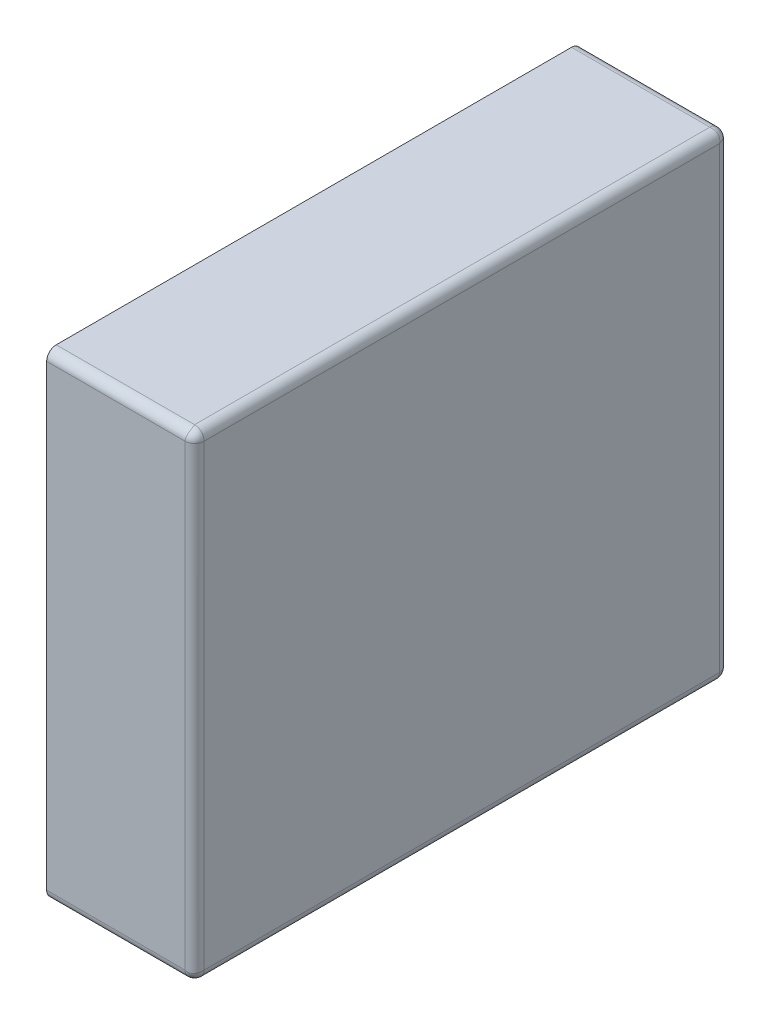
ISO-10303-21;
HEADER;
FILE_DESCRIPTION(('STEP AP214'),'2;1');
FILE_NAME('part.step','',(''),(''),'','','');
FILE_SCHEMA(('AUTOMOTIVE_DESIGN { 1 0 10303 214 1 1 1 1 }'));
ENDSEC;
DATA;
#1=APPLICATION_CONTEXT('core data for automotive mechanical design processes');
#2=APPLICATION_PROTOCOL_DEFINITION('international standard','automotive_design',2000,#1);
#3=PRODUCT_CONTEXT('',#1,'mechanical');
#4=PRODUCT('Part','Part','',(#3));
#5=PRODUCT_RELATED_PRODUCT_CATEGORY('part','',(#4));
#6=PRODUCT_DEFINITION_FORMATION('','',#4);
#7=PRODUCT_DEFINITION_CONTEXT('part definition',#1,'design');
#8=PRODUCT_DEFINITION('design','',#6,#7);
#9=PRODUCT_DEFINITION_SHAPE('','',#8);
#10=(LENGTH_UNIT() NAMED_UNIT(*) SI_UNIT(.MILLI.,.METRE.));
#11=(NAMED_UNIT(*) PLANE_ANGLE_UNIT() SI_UNIT($,.RADIAN.));
#12=(NAMED_UNIT(*) SI_UNIT($,.STERADIAN.) SOLID_ANGLE_UNIT());
#13=UNCERTAINTY_MEASURE_WITH_UNIT(LENGTH_MEASURE(1.E-05),#10,'distance_accuracy_value','');
#14=(GEOMETRIC_REPRESENTATION_CONTEXT(3) GLOBAL_UNCERTAINTY_ASSIGNED_CONTEXT((#13)) GLOBAL_UNIT_ASSIGNED_CONTEXT((#10,
#11,#12)) REPRESENTATION_CONTEXT('',''));
#15=CARTESIAN_POINT('',(0.,0.,0.));
#16=DIRECTION('',(0.,0.,1.));
#17=DIRECTION('',(1.,0.,0.));
#18=AXIS2_PLACEMENT_3D('',#15,#16,#17);
#19=CARTESIAN_POINT('',(0.25,-1.5583333105542,0.05));
#20=DIRECTION('',(-0.816496580927726,-0.408248290463864,-0.408248290463862));
#21=DIRECTION('',(0.577350269189626,-0.577350269189626,-0.577350269189625));
#22=AXIS2_PLACEMENT_3D('',#19,#20,#21);
#23=SPHERICAL_SURFACE('',#22,0.05);
#24=CARTESIAN_POINT('',(0.25,-1.5583333105542,0.05));
#25=DIRECTION('',(1.,0.,0.));
#26=DIRECTION('',(0.,0.,-1.));
#27=AXIS2_PLACEMENT_3D('',#24,#25,#26);
#28=CIRCLE('',#27,0.05);
#29=CARTESIAN_POINT('',(0.25,-1.6083333105542,0.05));
#30=VERTEX_POINT('',#29);
#31=CARTESIAN_POINT('',(0.25,-1.5583333105542,0.));
#32=VERTEX_POINT('',#31);
#33=EDGE_CURVE('E11',#30,#32,#28,.T.);
#34=ORIENTED_EDGE('',*,*,#33,.T.);
#35=CARTESIAN_POINT('',(0.25,-1.5583333105542,0.05));
#36=DIRECTION('',(0.,-1.,0.));
#37=DIRECTION('',(1.,0.,0.));
#38=AXIS2_PLACEMENT_3D('',#35,#36,#37);
#39=CIRCLE('',#38,0.05);
#40=CARTESIAN_POINT('',(0.3,-1.5583333105542,0.05));
#41=VERTEX_POINT('',#40);
#42=EDGE_CURVE('E24',#32,#41,#39,.T.);
#43=ORIENTED_EDGE('',*,*,#42,.T.);
#44=CARTESIAN_POINT('',(0.25,-1.5583333105542,0.05));
#45=DIRECTION('',(0.,0.,-1.));
#46=DIRECTION('',(0.,-1.,0.));
#47=AXIS2_PLACEMENT_3D('',#44,#45,#46);
#48=CIRCLE('',#47,0.05);
#49=EDGE_CURVE('E289',#41,#30,#48,.T.);
#50=ORIENTED_EDGE('',*,*,#49,.T.);
#51=EDGE_LOOP('',(#34,#43,#50));
#52=FACE_BOUND('',#51,.T.);
#53=ADVANCED_FACE('F17',(#52),#23,.T.);
#54=CARTESIAN_POINT('',(0.25,-1.5583333105542,2.75));
#55=DIRECTION('',(0.408248290463863,-0.408248290463863,-0.816496580927726));
#56=DIRECTION('',(0.577350269189625,-0.577350269189626,0.577350269189626));
#57=AXIS2_PLACEMENT_3D('',#54,#55,#56);
#58=SPHERICAL_SURFACE('',#57,0.05);
#59=CARTESIAN_POINT('',(0.25,-1.5583333105542,2.75));
#60=DIRECTION('',(1.,0.,0.));
#61=DIRECTION('',(0.,-1.,0.));
#62=AXIS2_PLACEMENT_3D('',#59,#60,#61);
#63=CIRCLE('',#62,0.05);
#64=CARTESIAN_POINT('',(0.25,-1.5583333105542,2.8));
#65=VERTEX_POINT('',#64);
#66=CARTESIAN_POINT('',(0.25,-1.6083333105542,2.75));
#67=VERTEX_POINT('',#66);
#68=EDGE_CURVE('E285',#65,#67,#63,.T.);
#69=ORIENTED_EDGE('',*,*,#68,.T.);
#70=CARTESIAN_POINT('',(0.25,-1.5583333105542,2.75));
#71=DIRECTION('',(0.,0.,1.));
#72=DIRECTION('',(1.,0.,0.));
#73=AXIS2_PLACEMENT_3D('',#70,#71,#72);
#74=CIRCLE('',#73,0.05);
#75=CARTESIAN_POINT('',(0.3,-1.5583333105542,2.75));
#76=VERTEX_POINT('',#75);
#77=EDGE_CURVE('E287',#67,#76,#74,.T.);
#78=ORIENTED_EDGE('',*,*,#77,.T.);
#79=CARTESIAN_POINT('',(0.3,-1.5583333105542,2.75));
#80=CARTESIAN_POINT('',(0.300000020313967,-1.55838978719508,2.75083135242767));
#81=CARTESIAN_POINT('',(0.299979171317549,-1.55845447886576,2.75166211112483));
#82=CARTESIAN_POINT('',(0.299895695565037,-1.55859870174982,2.75332402424875));
#83=CARTESIAN_POINT('',(0.299832880868058,-1.55867829855564,2.75415516357154));
#84=CARTESIAN_POINT('',(0.299665097579262,-1.55885054522584,2.75581523610608));
#85=CARTESIAN_POINT('',(0.299559959502558,-1.55894324658754,2.75664414679495));
#86=CARTESIAN_POINT('',(0.299307372398355,-1.55913983137091,2.75829721664536));
#87=CARTESIAN_POINT('',(0.299159773963409,-1.55924375345445,2.75912134835722));
#88=CARTESIAN_POINT('',(0.298822292392348,-1.55946083930706,2.76076234724915));
#89=CARTESIAN_POINT('',(0.298632281058567,-1.55957403042181,2.76157918442682));
#90=CARTESIAN_POINT('',(0.298210195281024,-1.55980765473083,2.76320313201674));
#91=CARTESIAN_POINT('',(0.297978014684369,-1.55992810567705,2.76401021227114));
#92=CARTESIAN_POINT('',(0.297472005262752,-1.56017420274978,2.76561224116745));
#93=CARTESIAN_POINT('',(0.297198092814036,-1.56029985893012,2.76640716184318));
#94=CARTESIAN_POINT('',(0.296609228401466,-1.56055428410327,2.76798253353389));
#95=CARTESIAN_POINT('',(0.29629421548598,-1.56068305748316,2.76876296105217));
#96=CARTESIAN_POINT('',(0.29562395131688,-1.56094161136505,2.7703070834178));
#97=CARTESIAN_POINT('',(0.295268661584212,-1.56107139271792,2.77107076141787));
#98=CARTESIAN_POINT('',(0.294518835357465,-1.5613298458026,2.77257920486178));
#99=CARTESIAN_POINT('',(0.294124282319878,-1.56145851704164,2.7733239621661));
#100=CARTESIAN_POINT('',(0.293297108379355,-1.56171263446717,2.77479247507204));
#101=CARTESIAN_POINT('',(0.292864492001337,-1.56183808103473,2.77551623315645));
#102=CARTESIAN_POINT('',(0.291962553597264,-1.56208364738235,2.77694075639946));
#103=CARTESIAN_POINT('',(0.291493255977843,-1.5622037706224,2.77764153641367));
#104=CARTESIAN_POINT('',(0.290519495705679,-1.56243661461909,2.7790182169205));
#105=CARTESIAN_POINT('',(0.290015075848481,-1.56254934407038,2.77969414620939));
#106=CARTESIAN_POINT('',(0.288972784289588,-1.56276536306717,2.78101934949802));
#107=CARTESIAN_POINT('',(0.288434971990044,-1.56286866861168,2.78166866760279));
#108=CARTESIAN_POINT('',(0.287327774609329,-1.56306385270868,2.78293898925504));
#109=CARTESIAN_POINT('',(0.286758463484927,-1.56315575651191,2.78356005336898));
#110=CARTESIAN_POINT('',(0.285590305843476,-1.56332621220327,2.7847723293902));
#111=CARTESIAN_POINT('',(0.28499154553938,-1.56340480038347,2.7853636192483));
#112=CARTESIAN_POINT('',(0.283766676890247,-1.56354677359816,2.78651493527515));
#113=CARTESIAN_POINT('',(0.283140664496341,-1.56361020756323,2.78707505745919));
#114=CARTESIAN_POINT('',(0.281863619839021,-1.56372010598015,2.78816275678178));
#115=CARTESIAN_POINT('',(0.281212690558093,-1.56376663337246,2.78869044842568));
#116=CARTESIAN_POINT('',(0.279888271236327,-1.56384104789288,2.78971213879615));
#117=CARTESIAN_POINT('',(0.279214888348585,-1.56386901308495,2.79020627067896));
#118=CARTESIAN_POINT('',(0.277848141278855,-1.56390473834771,2.79115982988534));
#119=CARTESIAN_POINT('',(0.277154885445235,-1.56391259243202,2.79161940890336));
#120=CARTESIAN_POINT('',(0.275751081087255,-1.56390664626746,2.79250298909048));
#121=CARTESIAN_POINT('',(0.275040639060477,-1.5638929564933,2.79292716009926));
#122=CARTESIAN_POINT('',(0.273605248184243,-1.56384259819796,2.79373919083561));
#123=CARTESIAN_POINT('',(0.272880400913832,-1.5638060567854,2.79412723787));
#124=CARTESIAN_POINT('',(0.271419070457526,-1.56370880417603,2.79486642792602));
#125=CARTESIAN_POINT('',(0.270682680895238,-1.56364823653573,2.79521777475648));
#126=CARTESIAN_POINT('',(0.269201208347948,-1.56350188148719,2.7958831127108));
#127=CARTESIAN_POINT('',(0.268456208087868,-1.56341625352492,2.79619732289344));
#128=CARTESIAN_POINT('',(0.266960517038454,-1.56321887666677,2.79678807615493));
#129=CARTESIAN_POINT('',(0.266209895271862,-1.56310730216158,2.79706485201088));
#130=CARTESIAN_POINT('',(0.264706002926951,-1.56285728385359,2.79758056582694));
#131=CARTESIAN_POINT('',(0.263952785138195,-1.5627190280733,2.79781974846915));
#132=CARTESIAN_POINT('',(0.262446796385434,-1.56241506595262,2.79826023919175));
#133=CARTESIAN_POINT('',(0.261694059537444,-1.56224955951653,2.79846180182021));
#134=CARTESIAN_POINT('',(0.260192060427522,-1.56189065428056,2.79882716569432));
#135=CARTESIAN_POINT('',(0.259442812292273,-1.56169746538555,2.7989912289485));
#136=CARTESIAN_POINT('',(0.258321945507501,-1.56138604292381,2.79920955873537));
#137=CARTESIAN_POINT('',(0.257949832604319,-1.56127894943598,2.79927756015494));
#138=CARTESIAN_POINT('',(0.257207637428366,-1.5610577417209,2.7994042588909));
#139=CARTESIAN_POINT('',(0.256837552741953,-1.56094365499532,2.79946298976778));
#140=CARTESIAN_POINT('',(0.256099812695661,-1.56070846003553,2.79957119336077));
#141=CARTESIAN_POINT('',(0.255732153421865,-1.56058737954348,2.79962069975311));
#142=CARTESIAN_POINT('',(0.254999641822439,-1.56033820255821,2.7997105129861));
#143=CARTESIAN_POINT('',(0.254634784141684,-1.56021013397265,2.79975085351181));
#144=CARTESIAN_POINT('',(0.253908256305697,-1.55994699823989,2.79982239989622));
#145=CARTESIAN_POINT('',(0.253546579332125,-1.55981195906698,2.79985363936352));
#146=CARTESIAN_POINT('',(0.25282678964261,-1.55953491034398,2.79990705649925));
#147=CARTESIAN_POINT('',(0.252468668656838,-1.55939292873802,2.79992926760641));
#148=CARTESIAN_POINT('',(0.251756364451594,-1.55910203332603,2.79996470752091));
#149=CARTESIAN_POINT('',(0.251402171529021,-1.55895314733816,2.79997796950743));
#150=CARTESIAN_POINT('',(0.250698095332166,-1.55864849552808,2.79999560007552));
#151=CARTESIAN_POINT('',(0.250348200942932,-1.55849275728552,2.8000000014759));
#152=CARTESIAN_POINT('',(0.25,-1.5583333105542,2.8));
#153=B_SPLINE_CURVE_WITH_KNOTS('',3,(#79,#80,#81,#82,#83,#84,#85,#86,#87,#88,#89,#90,#91,#92,
#93,#94,#95,#96,#97,#98,#99,#100,#101,#102,#103,#104,#105,#106,#107,#108,#109,#110,#111,#112,
#113,#114,#115,#116,#117,#118,#119,#120,#121,#122,#123,#124,#125,#126,#127,#128,#129,#130,#131,
#132,#133,#134,#135,#136,#137,#138,#139,#140,#141,#142,#143,#144,#145,#146,#147,#148,#149,#150,
#151,#152),.UNSPECIFIED.,.F.,.F.,(4,2,2,2,2,2,2,2,2,2,2,2,2,2,2,2,2,2,2,2,2,2,2,2,2,2,2,2,2,2,2,
2,2,2,2,2,4),(0.,0.00249945349828842,0.00501017636236163,0.00753105510997415,0.010060915036224,
0.0125985278601289,0.0151426194708621,0.017691877752768,0.0202449604712911,0.0228005032044076,
0.0253571273060388,0.0279134478892864,0.0304680818182009,0.0330196556971652,0.0355668138468767,
0.0381082262553104,0.0406425964909794,0.0431686695642028,0.0456852397199662,0.048191158143267,
0.0506853405545278,0.0531667746687542,0.0556345274875086,0.0580877523875283,0.0605256959638785,
0.0629477045789643,0.0653532305615733,0.0677418379925142,0.0701132080055176,0.0712924926926685,
0.0724674051483095,0.0736379404537152,0.0748041017706804,0.0759659004268234,0.077123355986903,
0.0782764963093341,0.0794253575870824),.UNSPECIFIED.);
#154=EDGE_CURVE('E253',#76,#65,#153,.T.);
#155=ORIENTED_EDGE('',*,*,#154,.T.);
#156=EDGE_LOOP('',(#69,#78,#155));
#157=FACE_BOUND('',#156,.T.);
#158=ADVANCED_FACE('F270',(#157),#58,.T.);
#159=CARTESIAN_POINT('',(0.25,-1.5583333105542,0.));
#160=DIRECTION('',(0.,0.,1.));
#161=DIRECTION('',(0.707106781186548,-0.707106781186548,0.));
#162=AXIS2_PLACEMENT_3D('',#159,#160,#161);
#163=CYLINDRICAL_SURFACE('',#162,0.05);
#164=ORIENTED_EDGE('',*,*,#77,.F.);
#165=DIRECTION('',(0.,0.,-1.));
#166=VECTOR('',#165,1.);
#167=CARTESIAN_POINT('',(0.25,-1.6083333105542,0.));
#168=LINE('',#167,#166);
#169=EDGE_CURVE('E250',#67,#30,#168,.T.);
#170=ORIENTED_EDGE('',*,*,#169,.T.);
#171=ORIENTED_EDGE('',*,*,#49,.F.);
#172=DIRECTION('',(0.,0.,1.));
#173=VECTOR('',#172,1.);
#174=CARTESIAN_POINT('',(0.3,-1.5583333105542,0.));
#175=LINE('',#174,#173);
#176=EDGE_CURVE('E247',#41,#76,#175,.T.);
#177=ORIENTED_EDGE('',*,*,#176,.T.);
#178=EDGE_LOOP('',(#164,#170,#171,#177));
#179=FACE_BOUND('',#178,.T.);
#180=ADVANCED_FACE('F228',(#179),#163,.T.);
#181=CARTESIAN_POINT('',(0.25,0.841666689445808,0.05));
#182=DIRECTION('',(-0.816496580927726,0.408248290463864,-0.408248290463862));
#183=DIRECTION('',(0.577350269189626,0.577350269189626,-0.577350269189626));
#184=AXIS2_PLACEMENT_3D('',#181,#182,#183);
#185=SPHERICAL_SURFACE('',#184,0.05);
#186=CARTESIAN_POINT('',(0.3,0.841666689445808,0.05));
#187=CARTESIAN_POINT('',(0.300000001475902,0.841826136177128,0.0496517990570679));
#188=CARTESIAN_POINT('',(0.299995600075518,0.841981874419691,0.0493019046678338));
#189=CARTESIAN_POINT('',(0.299977969507428,0.842286526229773,0.0485978284709789));
#190=CARTESIAN_POINT('',(0.29996470752091,0.842435412217634,0.0482436355484063));
#191=CARTESIAN_POINT('',(0.29992926760641,0.842726307629632,0.0475313313431616));
#192=CARTESIAN_POINT('',(0.299907056499251,0.842868289235589,0.04717321035739));
#193=CARTESIAN_POINT('',(0.299853639363523,0.843145337958589,0.0464534206678749));
#194=CARTESIAN_POINT('',(0.299822399896224,0.843280377131498,0.0460917436943032));
#195=CARTESIAN_POINT('',(0.299750853511815,0.843543512864263,0.0453652158583164));
#196=CARTESIAN_POINT('',(0.299710512986096,0.843671581449818,0.0450003581775609));
#197=CARTESIAN_POINT('',(0.299620699753114,0.843920758435086,0.0442678465781354));
#198=CARTESIAN_POINT('',(0.299571193360768,0.844041838927135,0.0439001873043393));
#199=CARTESIAN_POINT('',(0.299462989767779,0.844277033886932,0.0431624472580472));
#200=CARTESIAN_POINT('',(0.2994042588909,0.844391120612505,0.0427923625716341));
#201=CARTESIAN_POINT('',(0.299277560154943,0.844612328327585,0.0420501673956814));
#202=CARTESIAN_POINT('',(0.29920955873537,0.844719421815417,0.0416780544924992));
#203=CARTESIAN_POINT('',(0.298991228948502,0.845030844277154,0.0405571877077268));
#204=CARTESIAN_POINT('',(0.298827165694317,0.845224033172167,0.0398079395724777));
#205=CARTESIAN_POINT('',(0.298461801820209,0.845582938408141,0.0383059404625555));
#206=CARTESIAN_POINT('',(0.298260239191747,0.845748444844225,0.0375532036145659));
#207=CARTESIAN_POINT('',(0.29781974846915,0.846052406964906,0.0360472148618045));
#208=CARTESIAN_POINT('',(0.297580565826942,0.846190662745201,0.035293997073049));
#209=CARTESIAN_POINT('',(0.297064852010877,0.846440681053184,0.0337901047281377));
#210=CARTESIAN_POINT('',(0.296788076154931,0.846552255558383,0.0330394829615458));
#211=CARTESIAN_POINT('',(0.296197322893436,0.846749632416525,0.0315437919121317));
#212=CARTESIAN_POINT('',(0.295883112710797,0.8468352603788,0.0307987916520525));
#213=CARTESIAN_POINT('',(0.295217774756478,0.846981615427333,0.0293173191047621));
#214=CARTESIAN_POINT('',(0.294866427926017,0.847042183067639,0.0285809295424739));
#215=CARTESIAN_POINT('',(0.294127237870004,0.847139435677007,0.0271195990861678));
#216=CARTESIAN_POINT('',(0.293739190835606,0.847175977089571,0.0263947518157568));
#217=CARTESIAN_POINT('',(0.292927160099263,0.847226335384911,0.024959360939523));
#218=CARTESIAN_POINT('',(0.292502989090476,0.847240025159069,0.0242489189127446));
#219=CARTESIAN_POINT('',(0.291619408903357,0.847245971323631,0.022845114554765));
#220=CARTESIAN_POINT('',(0.291159829885339,0.847238117239316,0.0221518587211452));
#221=CARTESIAN_POINT('',(0.290206270678963,0.847202391976558,0.0207851116514152));
#222=CARTESIAN_POINT('',(0.289712138796154,0.847174426784487,0.0201117287636731));
#223=CARTESIAN_POINT('',(0.288690448425676,0.847100012264066,0.018787309441907));
#224=CARTESIAN_POINT('',(0.288162756781776,0.847053484871761,0.0181363801609791));
#225=CARTESIAN_POINT('',(0.287075057459189,0.846943586454834,0.0168593355036592));
#226=CARTESIAN_POINT('',(0.286514935275151,0.846880152489767,0.0162333231097527));
#227=CARTESIAN_POINT('',(0.2853636192483,0.846738179275083,0.0150084544606196));
#228=CARTESIAN_POINT('',(0.284772329390201,0.846659591094879,0.0144096941565242));
#229=CARTESIAN_POINT('',(0.283560053368979,0.846489135403516,0.0132415365150735));
#230=CARTESIAN_POINT('',(0.282938989255036,0.846397231600287,0.0126722253906709));
#231=CARTESIAN_POINT('',(0.281668667602786,0.846202047503286,0.0115650280099562));
#232=CARTESIAN_POINT('',(0.281019349498018,0.846098741958783,0.0110272157104117));
#233=CARTESIAN_POINT('',(0.279694146209385,0.845882722961985,0.00998492415151916));
#234=CARTESIAN_POINT('',(0.279018216920503,0.845769993510699,0.00948050429432074));
#235=CARTESIAN_POINT('',(0.277641536413672,0.845537149514013,0.00850674402215684));
#236=CARTESIAN_POINT('',(0.276940756399464,0.845417026273957,0.0080374464027357));
#237=CARTESIAN_POINT('',(0.27551623315645,0.845171459926336,0.00713550799866327));
#238=CARTESIAN_POINT('',(0.274792475072041,0.84504601335878,0.00670289162064473));
#239=CARTESIAN_POINT('',(0.273323962166104,0.844791895933245,0.00587571768012181));
#240=CARTESIAN_POINT('',(0.272579204861783,0.844663224694207,0.00548116464253525));
#241=CARTESIAN_POINT('',(0.271070761417873,0.84440477160953,0.00473133841578785));
#242=CARTESIAN_POINT('',(0.270307083417801,0.844274990256661,0.00437604868311979));
#243=CARTESIAN_POINT('',(0.26876296105217,0.844016436374764,0.00370578451402038));
#244=CARTESIAN_POINT('',(0.267982533533888,0.843887662994882,0.00339077159853354));
#245=CARTESIAN_POINT('',(0.266407161843179,0.843633237821733,0.00280190718596448));
#246=CARTESIAN_POINT('',(0.265612241167447,0.843507581641384,0.00252799473724834));
#247=CARTESIAN_POINT('',(0.264010212271137,0.843261484568661,0.00202198531563093));
#248=CARTESIAN_POINT('',(0.263203132016743,0.843141033622434,0.00178980471897604));
#249=CARTESIAN_POINT('',(0.261579184426824,0.842907409313417,0.00136771894143311));
#250=CARTESIAN_POINT('',(0.260762347249152,0.84279421819867,0.00117770760765169));
#251=CARTESIAN_POINT('',(0.259121348357221,0.842577132346058,0.000840226036591079));
#252=CARTESIAN_POINT('',(0.258297216645363,0.842473210262514,0.000692627601644534));
#253=CARTESIAN_POINT('',(0.256644146794953,0.842276625479144,0.000440040497442491));
#254=CARTESIAN_POINT('',(0.255815236106077,0.842183924117451,0.000334902420738303));
#255=CARTESIAN_POINT('',(0.254155163571538,0.842011677447247,0.000167119131942066));
#256=CARTESIAN_POINT('',(0.253324024248752,0.841932080641431,0.000104304434962569));
#257=CARTESIAN_POINT('',(0.251662111124828,0.841787857757365,2.08286824513746E-05));
#258=CARTESIAN_POINT('',(0.250831352427667,0.84172316608669,-2.03139669171693E-08));
#259=CARTESIAN_POINT('',(0.25,0.841666689445808,0.));
#260=B_SPLINE_CURVE_WITH_KNOTS('',3,(#186,#187,#188,#189,#190,#191,#192,#193,#194,#195,#196,
#197,#198,#199,#200,#201,#202,#203,#204,#205,#206,#207,#208,#209,#210,#211,#212,#213,#214,#215,
#216,#217,#218,#219,#220,#221,#222,#223,#224,#225,#226,#227,#228,#229,#230,#231,#232,#233,#234,
#235,#236,#237,#238,#239,#240,#241,#242,#243,#244,#245,#246,#247,#248,#249,#250,#251,#252,#253,
#254,#255,#256,#257,#258,#259),.UNSPECIFIED.,.F.,.F.,(4,2,2,2,2,2,2,2,2,2,2,2,2,2,2,2,2,2,2,2,2,
2,2,2,2,2,2,2,2,2,2,2,2,2,2,2,4),(0.,0.00114886127774824,0.00230200160017933,
0.00345945716025897,0.00462125581640201,0.0057874171333672,0.00695795243877281,
0.0081328648944139,0.00931214958156477,0.0116835195945681,0.0140721270255091,0.0164776530081182,
0.0188996616232039,0.0213376051995541,0.0237908300995737,0.0262585829183281,0.0287400170325546,
0.0312341994438155,0.0337401178671161,0.0362566880228797,0.0387827610961029,0.0413171313317719,
0.0438585437402056,0.046405701889917,0.0489572757688815,0.0515119096977957,0.0540682302810434,
0.0566248543826747,0.0591803971157914,0.0617334798343145,0.0642827381162204,0.0668268297269536,
0.0693644425508582,0.0718943024771082,0.0744151812247207,0.0769259040887938,0.0794253575870824),.UNSPECIFIED.);
#261=CARTESIAN_POINT('',(0.3,0.841666689445808,0.05));
#262=VERTEX_POINT('',#261);
#263=CARTESIAN_POINT('',(0.25,0.841666689445808,0.));
#264=VERTEX_POINT('',#263);
#265=EDGE_CURVE('E243',#262,#264,#260,.T.);
#266=ORIENTED_EDGE('',*,*,#265,.T.);
#267=CARTESIAN_POINT('',(0.25,0.841666689445808,0.05));
#268=DIRECTION('',(1.,0.,0.));
#269=DIRECTION('',(0.,1.,0.));
#270=AXIS2_PLACEMENT_3D('',#267,#268,#269);
#271=CIRCLE('',#270,0.05);
#272=CARTESIAN_POINT('',(0.25,0.891666689445808,0.05));
#273=VERTEX_POINT('',#272);
#274=EDGE_CURVE('E347',#264,#273,#271,.T.);
#275=ORIENTED_EDGE('',*,*,#274,.T.);
#276=CARTESIAN_POINT('',(0.25,0.891666689445808,0.05));
#277=CARTESIAN_POINT('',(0.250831352427667,0.891666709759775,0.0499435233591183));
#278=CARTESIAN_POINT('',(0.251662111124828,0.891645860763357,0.0498788316884434));
#279=CARTESIAN_POINT('',(0.253324024248752,0.891562385010845,0.0497346088043771));
#280=CARTESIAN_POINT('',(0.254155163571538,0.891499570313866,0.0496550119985609));
#281=CARTESIAN_POINT('',(0.255815236106077,0.89133178702507,0.0494827653283566));
#282=CARTESIAN_POINT('',(0.256644146794953,0.891226648948365,0.0493900639666642));
#283=CARTESIAN_POINT('',(0.258297216645362,0.890974061844164,0.0491934791832936));
#284=CARTESIAN_POINT('',(0.25912134835722,0.890826463409217,0.0490895570997497));
#285=CARTESIAN_POINT('',(0.260762347249152,0.890488981838156,0.0488724712471381));
#286=CARTESIAN_POINT('',(0.261579184426824,0.890298970504375,0.0487592801323913));
#287=CARTESIAN_POINT('',(0.263203132016743,0.889876884726832,0.0485256558233742));
#288=CARTESIAN_POINT('',(0.264010212271137,0.889644704130177,0.0484052048771468));
#289=CARTESIAN_POINT('',(0.265612241167447,0.88913869470856,0.0481591078044245));
#290=CARTESIAN_POINT('',(0.266407161843179,0.888864782259843,0.0480334516240749));
#291=CARTESIAN_POINT('',(0.267982533533888,0.888275917847274,0.0477790264509255));
#292=CARTESIAN_POINT('',(0.26876296105217,0.887960904931788,0.0476502530710441));
#293=CARTESIAN_POINT('',(0.270307083417801,0.887290640762688,0.0473916991891467));
#294=CARTESIAN_POINT('',(0.271070761417873,0.88693535103002,0.0472619178362776));
#295=CARTESIAN_POINT('',(0.272579204861783,0.886185524803273,0.0470034647516007));
#296=CARTESIAN_POINT('',(0.273323962166104,0.885790971765686,0.0468747935125628));
#297=CARTESIAN_POINT('',(0.274792475072041,0.884963797825163,0.0466206760870283));
#298=CARTESIAN_POINT('',(0.27551623315645,0.884531181447145,0.046495229519472));
#299=CARTESIAN_POINT('',(0.276940756399464,0.883629243043072,0.0462496631718509));
#300=CARTESIAN_POINT('',(0.277641536413672,0.883159945423651,0.0461295399317952));
#301=CARTESIAN_POINT('',(0.279018216920503,0.882186185151487,0.045896695935109));
#302=CARTESIAN_POINT('',(0.279694146209385,0.881681765294289,0.0457839664838229));
#303=CARTESIAN_POINT('',(0.281019349498018,0.880639473735396,0.0455679474870255));
#304=CARTESIAN_POINT('',(0.281668667602786,0.880101661435852,0.0454646419425221));
#305=CARTESIAN_POINT('',(0.282938989255036,0.878994464055137,0.0452694578455207));
#306=CARTESIAN_POINT('',(0.283560053368979,0.878425152930734,0.0451775540422923));
#307=CARTESIAN_POINT('',(0.284772329390201,0.877256995289284,0.0450070983509292));
#308=CARTESIAN_POINT('',(0.2853636192483,0.876658234985188,0.044928510170725));
#309=CARTESIAN_POINT('',(0.286514935275151,0.875433366336055,0.0447865369560409));
#310=CARTESIAN_POINT('',(0.287075057459189,0.874807353942149,0.0447231029909742));
#311=CARTESIAN_POINT('',(0.288162756781776,0.873530309284829,0.0446132045740466));
#312=CARTESIAN_POINT('',(0.288690448425676,0.872879380003901,0.0445666771817416));
#313=CARTESIAN_POINT('',(0.289712138796154,0.871554960682135,0.0444922626613215));
#314=CARTESIAN_POINT('',(0.290206270678963,0.870881577794393,0.04446429746925));
#315=CARTESIAN_POINT('',(0.291159829885339,0.869514830724663,0.0444285722064917));
#316=CARTESIAN_POINT('',(0.291619408903357,0.868821574891043,0.0444207181221764));
#317=CARTESIAN_POINT('',(0.292502989090476,0.867417770533063,0.0444266642867391));
#318=CARTESIAN_POINT('',(0.292927160099263,0.866707328506285,0.0444403540608964));
#319=CARTESIAN_POINT('',(0.293739190835606,0.865271937630051,0.0444907123562374));
#320=CARTESIAN_POINT('',(0.294127237870004,0.86454709035964,0.0445272537688011));
#321=CARTESIAN_POINT('',(0.294866427926017,0.863085759903334,0.0446245063781686));
#322=CARTESIAN_POINT('',(0.295217774756478,0.862349370341046,0.0446850740184745));
#323=CARTESIAN_POINT('',(0.295883112710797,0.860867897793755,0.0448314290670078));
#324=CARTESIAN_POINT('',(0.296197322893436,0.860122897533676,0.0449170570292829));
#325=CARTESIAN_POINT('',(0.296788076154931,0.858627206484262,0.0451144338874251));
#326=CARTESIAN_POINT('',(0.297064852010877,0.85787658471767,0.0452260083926238));
#327=CARTESIAN_POINT('',(0.297580565826942,0.856372692372759,0.0454760267006072));
#328=CARTESIAN_POINT('',(0.29781974846915,0.855619474584003,0.0456142824809018));
#329=CARTESIAN_POINT('',(0.298260239191747,0.854113485831242,0.0459182446015831));
#330=CARTESIAN_POINT('',(0.298461801820209,0.853360748983252,0.0460837510376664));
#331=CARTESIAN_POINT('',(0.298827165694317,0.85185874987333,0.0464426562736405));
#332=CARTESIAN_POINT('',(0.298991228948502,0.851109501738081,0.0466358451686541));
#333=CARTESIAN_POINT('',(0.29920955873537,0.849988634953309,0.0469472676303907));
#334=CARTESIAN_POINT('',(0.299277560154943,0.849616522050126,0.0470543611182232));
#335=CARTESIAN_POINT('',(0.2994042588909,0.848874326874174,0.0472755688333026));
#336=CARTESIAN_POINT('',(0.299462989767779,0.848504242187761,0.0473896555588764));
#337=CARTESIAN_POINT('',(0.299571193360768,0.847766502141469,0.0476248505186726));
#338=CARTESIAN_POINT('',(0.299620699753114,0.847398842867673,0.047745931010722));
#339=CARTESIAN_POINT('',(0.299710512986096,0.846666331268247,0.0479951079959894));
#340=CARTESIAN_POINT('',(0.299750853511815,0.846301473587492,0.0481231765815452));
#341=CARTESIAN_POINT('',(0.299822399896224,0.845574945751505,0.0483863123143096));
#342=CARTESIAN_POINT('',(0.299853639363523,0.845213268777933,0.0485213514872186));
#343=CARTESIAN_POINT('',(0.299907056499251,0.844493479088418,0.0487984002102192));
#344=CARTESIAN_POINT('',(0.29992926760641,0.844135358102646,0.0489403818161762));
#345=CARTESIAN_POINT('',(0.29996470752091,0.843423053897402,0.0492312772281742));
#346=CARTESIAN_POINT('',(0.299977969507428,0.843068860974829,0.0493801632160354));
#347=CARTESIAN_POINT('',(0.299995600075518,0.842364784777974,0.0496848150261171));
#348=CARTESIAN_POINT('',(0.300000001475902,0.84201489038874,0.0498405532686796));
#349=CARTESIAN_POINT('',(0.3,0.841666689445808,0.05));
#350=B_SPLINE_CURVE_WITH_KNOTS('',3,(#276,#277,#278,#279,#280,#281,#282,#283,#284,#285,#286,
#287,#288,#289,#290,#291,#292,#293,#294,#295,#296,#297,#298,#299,#300,#301,#302,#303,#304,#305,
#306,#307,#308,#309,#310,#311,#312,#313,#314,#315,#316,#317,#318,#319,#320,#321,#322,#323,#324,
#325,#326,#327,#328,#329,#330,#331,#332,#333,#334,#335,#336,#337,#338,#339,#340,#341,#342,#343,
#344,#345,#346,#347,#348,#349),.UNSPECIFIED.,.F.,.F.,(4,2,2,2,2,2,2,2,2,2,2,2,2,2,2,2,2,2,2,2,2,
2,2,2,2,2,2,2,2,2,2,2,2,2,2,2,4),(0.,0.00249945349828859,0.00501017636236174,
0.00753105510997417,0.0100609150362242,0.0125985278601289,0.0151426194708621,0.017691877752768,
0.020244960471291,0.0228005032044077,0.0253571273060391,0.0279134478892867,0.030468081818201,
0.0330196556971655,0.0355668138468769,0.0381082262553106,0.0406425964909796,0.0431686695642028,
0.0456852397199665,0.0481911581432671,0.050685340554528,0.0531667746687543,0.0556345274875088,
0.0580877523875284,0.0605256959638786,0.0629477045789644,0.0653532305615734,0.0677418379925144,
0.0701132080055177,0.0712924926926686,0.0724674051483096,0.0736379404537153,0.0748041017706804,
0.0759659004268235,0.0771233559869032,0.0782764963093343,0.0794253575870826),.UNSPECIFIED.);
#351=EDGE_CURVE('E211',#273,#262,#350,.T.);
#352=ORIENTED_EDGE('',*,*,#351,.T.);
#353=EDGE_LOOP('',(#266,#275,#352));
#354=FACE_BOUND('',#353,.T.);
#355=ADVANCED_FACE('F218',(#354),#185,.T.);
#356=CARTESIAN_POINT('',(0.10625,0.841666689445808,0.05));
#357=DIRECTION('',(1.,0.,0.));
#358=DIRECTION('',(0.,0.707106781186548,-0.707106781186547));
#359=AXIS2_PLACEMENT_3D('',#356,#357,#358);
#360=CYLINDRICAL_SURFACE('',#359,0.05);
#361=CARTESIAN_POINT('',(-0.475,0.841666689445808,0.05));
#362=DIRECTION('',(1.,0.,0.));
#363=DIRECTION('',(0.,0.707106781186548,-0.707106781186547));
#364=AXIS2_PLACEMENT_3D('',#361,#362,#363);
#365=CIRCLE('',#364,0.05);
#366=CARTESIAN_POINT('',(-0.475,0.841666689445808,0.));
#367=VERTEX_POINT('',#366);
#368=CARTESIAN_POINT('',(-0.475,0.891666689445808,0.05));
#369=VERTEX_POINT('',#368);
#370=EDGE_CURVE('E201',#367,#369,#365,.T.);
#371=ORIENTED_EDGE('',*,*,#370,.T.);
#372=DIRECTION('',(1.,0.,0.));
#373=VECTOR('',#372,1.);
#374=CARTESIAN_POINT('',(0.10625,0.891666689445808,0.05));
#375=LINE('',#374,#373);
#376=EDGE_CURVE('E310',#369,#273,#375,.T.);
#377=ORIENTED_EDGE('',*,*,#376,.T.);
#378=ORIENTED_EDGE('',*,*,#274,.F.);
#379=DIRECTION('',(-1.,0.,0.));
#380=VECTOR('',#379,1.);
#381=CARTESIAN_POINT('',(0.10625,0.841666689445808,0.));
#382=LINE('',#381,#380);
#383=EDGE_CURVE('E317',#264,#367,#382,.T.);
#384=ORIENTED_EDGE('',*,*,#383,.T.);
#385=EDGE_LOOP('',(#371,#377,#378,#384));
#386=FACE_BOUND('',#385,.T.);
#387=ADVANCED_FACE('F227',(#386),#360,.T.);
#388=CARTESIAN_POINT('',(0.25,0.841666689445808,2.75));
#389=DIRECTION('',(0.408248290463862,-0.816496580927724,0.408248290463868));
#390=DIRECTION('',(0.577350269189626,0.577350269189629,0.577350269189622));
#391=AXIS2_PLACEMENT_3D('',#388,#389,#390);
#392=SPHERICAL_SURFACE('',#391,0.05);
#393=CARTESIAN_POINT('',(0.25,0.841666689445808,2.75));
#394=DIRECTION('',(0.,1.,0.));
#395=DIRECTION('',(1.,0.,0.));
#396=AXIS2_PLACEMENT_3D('',#393,#394,#395);
#397=CIRCLE('',#396,0.05);
#398=CARTESIAN_POINT('',(0.25,0.841666689445808,2.8));
#399=VERTEX_POINT('',#398);
#400=CARTESIAN_POINT('',(0.3,0.841666689445808,2.75));
#401=VERTEX_POINT('',#400);
#402=EDGE_CURVE('E328',#399,#401,#397,.T.);
#403=ORIENTED_EDGE('',*,*,#402,.T.);
#404=CARTESIAN_POINT('',(0.25,0.841666689445808,2.75));
#405=DIRECTION('',(0.,0.,1.));
#406=DIRECTION('',(0.,1.,0.));
#407=AXIS2_PLACEMENT_3D('',#404,#405,#406);
#408=CIRCLE('',#407,0.05);
#409=CARTESIAN_POINT('',(0.25,0.891666689445808,2.75));
#410=VERTEX_POINT('',#409);
#411=EDGE_CURVE('E331',#401,#410,#408,.T.);
#412=ORIENTED_EDGE('',*,*,#411,.T.);
#413=CARTESIAN_POINT('',(0.25,0.891666689445808,2.75));
#414=CARTESIAN_POINT('',(0.250159446731321,0.89166669092171,2.75034820094293));
#415=CARTESIAN_POINT('',(0.250315184973883,0.891662289521326,2.75069809533217));
#416=CARTESIAN_POINT('',(0.250619836783965,0.891644658953236,2.75140217152902));
#417=CARTESIAN_POINT('',(0.250768722771826,0.891631396966717,2.75175636445159));
#418=CARTESIAN_POINT('',(0.251059618183824,0.891595957052218,2.75246866865684));
#419=CARTESIAN_POINT('',(0.251201599789781,0.891573745945059,2.75282678964261));
#420=CARTESIAN_POINT('',(0.251478648512782,0.891520328809331,2.75354657933212));
#421=CARTESIAN_POINT('',(0.251613687685691,0.891489089342032,2.7539082563057));
#422=CARTESIAN_POINT('',(0.251876823418455,0.891417542957623,2.75463478414168));
#423=CARTESIAN_POINT('',(0.252004892004011,0.891377202431904,2.75499964182244));
#424=CARTESIAN_POINT('',(0.252254068989278,0.891287389198922,2.75573215342186));
#425=CARTESIAN_POINT('',(0.252375149481328,0.891237882806576,2.75609981269566));
#426=CARTESIAN_POINT('',(0.252610344441124,0.891129679213587,2.75683755274195));
#427=CARTESIAN_POINT('',(0.252724431166698,0.891070948336708,2.75720763742837));
#428=CARTESIAN_POINT('',(0.252945638881777,0.890944249600751,2.75794983260432));
#429=CARTESIAN_POINT('',(0.25305273236961,0.890876248181178,2.7583219455075));
#430=CARTESIAN_POINT('',(0.253364154831346,0.89065791839431,2.75944281229227));
#431=CARTESIAN_POINT('',(0.25355734372636,0.890493855140125,2.76019206042752));
#432=CARTESIAN_POINT('',(0.253916248962334,0.890128491266017,2.76169405953744));
#433=CARTESIAN_POINT('',(0.254081755398417,0.889926928637555,2.76244679638543));
#434=CARTESIAN_POINT('',(0.254385717519098,0.889486437914958,2.7639527851382));
#435=CARTESIAN_POINT('',(0.254523973299393,0.88924725527275,2.76470600292695));
#436=CARTESIAN_POINT('',(0.254773991607376,0.888731541456685,2.76620989527186));
#437=CARTESIAN_POINT('',(0.254885566112575,0.888454765600739,2.76696051703845));
#438=CARTESIAN_POINT('',(0.255082942970717,0.887864012339244,2.76845620808787));
#439=CARTESIAN_POINT('',(0.255168570932992,0.887549802156605,2.76920120834795));
#440=CARTESIAN_POINT('',(0.255314925981526,0.886884464202286,2.77068268089524));
#441=CARTESIAN_POINT('',(0.255375493621832,0.886533117371825,2.77141907045753));
#442=CARTESIAN_POINT('',(0.255472746231199,0.885793927315812,2.77288040091383));
#443=CARTESIAN_POINT('',(0.255509287643763,0.885405880281414,2.77360524818424));
#444=CARTESIAN_POINT('',(0.255559645939104,0.884593849545071,2.77504063906048));
#445=CARTESIAN_POINT('',(0.255573335713261,0.884169678536284,2.77575108108726));
#446=CARTESIAN_POINT('',(0.255579281877824,0.883286098349165,2.77715488544523));
#447=CARTESIAN_POINT('',(0.255571427793508,0.882826519331147,2.77784814127885));
#448=CARTESIAN_POINT('',(0.25553570253075,0.881872960124771,2.77921488834858));
#449=CARTESIAN_POINT('',(0.255507737338679,0.881378828241962,2.77988827123633));
#450=CARTESIAN_POINT('',(0.255433322818259,0.880357137871484,2.78121269055809));
#451=CARTESIAN_POINT('',(0.255386795425954,0.879829446227584,2.78186361983902));
#452=CARTESIAN_POINT('',(0.255276897009026,0.878741746904997,2.78314066449634));
#453=CARTESIAN_POINT('',(0.255213463043959,0.878181624720959,2.78376667689025));
#454=CARTESIAN_POINT('',(0.255071489829275,0.877030308694108,2.78499154553938));
#455=CARTESIAN_POINT('',(0.254992901649071,0.876439018836009,2.78559030584348));
#456=CARTESIAN_POINT('',(0.254822445957708,0.875226742814787,2.78675846348493));
#457=CARTESIAN_POINT('',(0.254730542154479,0.874605678700844,2.78732777460933));
#458=CARTESIAN_POINT('',(0.254535358057478,0.873335357048594,2.78843497199004));
#459=CARTESIAN_POINT('',(0.254432052512975,0.872686038943826,2.78897278428959));
#460=CARTESIAN_POINT('',(0.254216033516177,0.871360835655193,2.79001507584848));
#461=CARTESIAN_POINT('',(0.254103304064891,0.870684906366311,2.79051949570568));
#462=CARTESIAN_POINT('',(0.253870460068205,0.86930822585948,2.79149325597784));
#463=CARTESIAN_POINT('',(0.253750336828149,0.868607445845272,2.79196255359726));
#464=CARTESIAN_POINT('',(0.253504770480528,0.867182922602258,2.79286449200134));
#465=CARTESIAN_POINT('',(0.253379323912972,0.866459164517849,2.79329710837936));
#466=CARTESIAN_POINT('',(0.253125206487437,0.864990651611912,2.79412428231988));
#467=CARTESIAN_POINT('',(0.252996535248399,0.864245894307591,2.79451883535746));
#468=CARTESIAN_POINT('',(0.252738082163723,0.862737450863681,2.79526866158421));
#469=CARTESIAN_POINT('',(0.252608300810853,0.861973772863609,2.79562395131688));
#470=CARTESIAN_POINT('',(0.252349746928956,0.860429650497978,2.79629421548598));
#471=CARTESIAN_POINT('',(0.252220973549075,0.859649222979695,2.79660922840147));
#472=CARTESIAN_POINT('',(0.251966548375925,0.858073851288987,2.79719809281404));
#473=CARTESIAN_POINT('',(0.251840892195576,0.857278930613255,2.79747200526275));
#474=CARTESIAN_POINT('',(0.251594795122853,0.855676901716944,2.79797801468437));
#475=CARTESIAN_POINT('',(0.251474344176626,0.854869821462551,2.79821019528102));
#476=CARTESIAN_POINT('',(0.251240719867609,0.853245873872632,2.79863228105857));
#477=CARTESIAN_POINT('',(0.251127528752862,0.85242903669496,2.79882229239235));
#478=CARTESIAN_POINT('',(0.25091044290025,0.850788037803028,2.79915977396341));
#479=CARTESIAN_POINT('',(0.250806520816706,0.849963906091171,2.79930737239836));
#480=CARTESIAN_POINT('',(0.250609936033336,0.848310836240761,2.79955995950256));
#481=CARTESIAN_POINT('',(0.250517234671643,0.847481925551885,2.79966509757926));
#482=CARTESIAN_POINT('',(0.250344988001439,0.845821853017346,2.79983288086806));
#483=CARTESIAN_POINT('',(0.250265391195623,0.84499071369456,2.79989569556504));
#484=CARTESIAN_POINT('',(0.250121168311557,0.843328800570636,2.79997917131755));
#485=CARTESIAN_POINT('',(0.250056476640882,0.842498041873475,2.80000002031397));
#486=CARTESIAN_POINT('',(0.25,0.841666689445808,2.8));
#487=B_SPLINE_CURVE_WITH_KNOTS('',3,(#413,#414,#415,#416,#417,#418,#419,#420,#421,#422,#423,
#424,#425,#426,#427,#428,#429,#430,#431,#432,#433,#434,#435,#436,#437,#438,#439,#440,#441,#442,
#443,#444,#445,#446,#447,#448,#449,#450,#451,#452,#453,#454,#455,#456,#457,#458,#459,#460,#461,
#462,#463,#464,#465,#466,#467,#468,#469,#470,#471,#472,#473,#474,#475,#476,#477,#478,#479,#480,
#481,#482,#483,#484,#485,#486),.UNSPECIFIED.,.F.,.F.,(4,2,2,2,2,2,2,2,2,2,2,2,2,2,2,2,2,2,2,2,2,
2,2,2,2,2,2,2,2,2,2,2,2,2,2,2,4),(0.,0.00114886127774802,0.00230200160017907,
0.00345945716025874,0.00462125581640211,0.00578741713336698,0.00695795243877292,
0.00813286489441364,0.00931214958156481,0.0116835195945682,0.014072127025509,0.016477653008118,
0.018899661623204,0.0213376051995542,0.0237908300995738,0.0262585829183279,0.0287400170325545,
0.0312341994438153,0.0337401178671159,0.0362566880228798,0.0387827610961029,0.0413171313317719,
0.0438585437402057,0.0464057018899169,0.0489572757688815,0.0515119096977957,0.0540682302810435,
0.0566248543826747,0.0591803971157913,0.0617334798343145,0.0642827381162205,0.0668268297269535,
0.0693644425508582,0.0718943024771082,0.0744151812247207,0.0769259040887938,0.0794253575870824),.UNSPECIFIED.);
#488=EDGE_CURVE('E167',#410,#399,#487,.T.);
#489=ORIENTED_EDGE('',*,*,#488,.T.);
#490=EDGE_LOOP('',(#403,#412,#489));
#491=FACE_BOUND('',#490,.T.);
#492=ADVANCED_FACE('F192',(#491),#392,.T.);
#493=CARTESIAN_POINT('',(0.25,0.841666689445808,0.));
#494=DIRECTION('',(0.,0.,1.));
#495=DIRECTION('',(0.707106781186547,0.707106781186548,0.));
#496=AXIS2_PLACEMENT_3D('',#493,#494,#495);
#497=CYLINDRICAL_SURFACE('',#496,0.05);
#498=ORIENTED_EDGE('',*,*,#411,.F.);
#499=DIRECTION('',(0.,0.,-1.));
#500=VECTOR('',#499,1.);
#501=CARTESIAN_POINT('',(0.3,0.841666689445808,0.));
#502=LINE('',#501,#500);
#503=EDGE_CURVE('E162',#401,#262,#502,.T.);
#504=ORIENTED_EDGE('',*,*,#503,.T.);
#505=ORIENTED_EDGE('',*,*,#351,.F.);
#506=DIRECTION('',(0.,0.,1.));
#507=VECTOR('',#506,1.);
#508=CARTESIAN_POINT('',(0.25,0.891666689445808,0.));
#509=LINE('',#508,#507);
#510=EDGE_CURVE('E157',#273,#410,#509,.T.);
#511=ORIENTED_EDGE('',*,*,#510,.T.);
#512=EDGE_LOOP('',(#498,#504,#505,#511));
#513=FACE_BOUND('',#512,.T.);
#514=ADVANCED_FACE('F185',(#513),#497,.T.);
#515=CARTESIAN_POINT('',(0.10625,0.841666689445808,2.75));
#516=DIRECTION('',(-1.,0.,0.));
#517=DIRECTION('',(0.,0.707106781186548,0.707106781186548));
#518=AXIS2_PLACEMENT_3D('',#515,#516,#517);
#519=CYLINDRICAL_SURFACE('',#518,0.05);
#520=CARTESIAN_POINT('',(-0.475,0.841666689445808,2.75));
#521=DIRECTION('',(1.,0.,0.));
#522=DIRECTION('',(0.,0.707106781186548,0.707106781186548));
#523=AXIS2_PLACEMENT_3D('',#520,#521,#522);
#524=CIRCLE('',#523,0.05);
#525=CARTESIAN_POINT('',(-0.475,0.891666689445808,2.75));
#526=VERTEX_POINT('',#525);
#527=CARTESIAN_POINT('',(-0.475,0.841666689445808,2.8));
#528=VERTEX_POINT('',#527);
#529=EDGE_CURVE('E155',#526,#528,#524,.T.);
#530=ORIENTED_EDGE('',*,*,#529,.T.);
#531=DIRECTION('',(1.,0.,0.));
#532=VECTOR('',#531,1.);
#533=CARTESIAN_POINT('',(0.10625,0.841666689445808,2.8));
#534=LINE('',#533,#532);
#535=EDGE_CURVE('E150',#528,#399,#534,.T.);
#536=ORIENTED_EDGE('',*,*,#535,.T.);
#537=ORIENTED_EDGE('',*,*,#488,.F.);
#538=DIRECTION('',(-1.,0.,0.));
#539=VECTOR('',#538,1.);
#540=CARTESIAN_POINT('',(0.10625,0.891666689445808,2.75));
#541=LINE('',#540,#539);
#542=EDGE_CURVE('E145',#410,#526,#541,.T.);
#543=ORIENTED_EDGE('',*,*,#542,.T.);
#544=EDGE_LOOP('',(#530,#536,#537,#543));
#545=FACE_BOUND('',#544,.T.);
#546=ADVANCED_FACE('F174',(#545),#519,.T.);
#547=CARTESIAN_POINT('',(0.25,-0.983333310554192,2.75));
#548=DIRECTION('',(0.,1.,0.));
#549=DIRECTION('',(0.707106781186547,0.,0.707106781186548));
#550=AXIS2_PLACEMENT_3D('',#547,#548,#549);
#551=CYLINDRICAL_SURFACE('',#550,0.05);
#552=ORIENTED_EDGE('',*,*,#402,.F.);
#553=DIRECTION('',(0.,-1.,0.));
#554=VECTOR('',#553,1.);
#555=CARTESIAN_POINT('',(0.25,-0.983333310554192,2.8));
#556=LINE('',#555,#554);
#557=EDGE_CURVE('E140',#399,#65,#556,.T.);
#558=ORIENTED_EDGE('',*,*,#557,.T.);
#559=ORIENTED_EDGE('',*,*,#154,.F.);
#560=DIRECTION('',(0.,1.,0.));
#561=VECTOR('',#560,1.);
#562=CARTESIAN_POINT('',(0.3,-0.983333310554192,2.75));
#563=LINE('',#562,#561);
#564=EDGE_CURVE('E135',#76,#401,#563,.T.);
#565=ORIENTED_EDGE('',*,*,#564,.T.);
#566=EDGE_LOOP('',(#552,#558,#559,#565));
#567=FACE_BOUND('',#566,.T.);
#568=ADVANCED_FACE('F184',(#567),#551,.T.);
#569=CARTESIAN_POINT('',(0.25,-0.983333310554192,0.05));
#570=DIRECTION('',(0.,-1.,0.));
#571=DIRECTION('',(0.707106781186547,0.,-0.707106781186548));
#572=AXIS2_PLACEMENT_3D('',#569,#570,#571);
#573=CYLINDRICAL_SURFACE('',#572,0.05);
#574=ORIENTED_EDGE('',*,*,#42,.F.);
#575=DIRECTION('',(0.,1.,0.));
#576=VECTOR('',#575,1.);
#577=CARTESIAN_POINT('',(0.25,-0.983333310554192,0.));
#578=LINE('',#577,#576);
#579=EDGE_CURVE('E130',#32,#264,#578,.T.);
#580=ORIENTED_EDGE('',*,*,#579,.T.);
#581=ORIENTED_EDGE('',*,*,#265,.F.);
#582=DIRECTION('',(0.,-1.,0.));
#583=VECTOR('',#582,1.);
#584=CARTESIAN_POINT('',(0.3,-0.983333310554192,0.05));
#585=LINE('',#584,#583);
#586=EDGE_CURVE('E125',#262,#41,#585,.T.);
#587=ORIENTED_EDGE('',*,*,#586,.T.);
#588=EDGE_LOOP('',(#574,#580,#581,#587));
#589=FACE_BOUND('',#588,.T.);
#590=ADVANCED_FACE('F319',(#589),#573,.T.);
#591=CARTESIAN_POINT('',(-0.28125,-1.5583333105542,2.75));
#592=DIRECTION('',(1.,0.,0.));
#593=DIRECTION('',(0.,-0.707106781186548,0.707106781186548));
#594=AXIS2_PLACEMENT_3D('',#591,#592,#593);
#595=CYLINDRICAL_SURFACE('',#594,0.05);
#596=CARTESIAN_POINT('',(-0.475,-1.5583333105542,2.75));
#597=DIRECTION('',(1.,0.,0.));
#598=DIRECTION('',(0.,-0.707106781186548,0.707106781186548));
#599=AXIS2_PLACEMENT_3D('',#596,#597,#598);
#600=CIRCLE('',#599,0.05);
#601=CARTESIAN_POINT('',(-0.475,-1.5583333105542,2.8));
#602=VERTEX_POINT('',#601);
#603=CARTESIAN_POINT('',(-0.475,-1.6083333105542,2.75));
#604=VERTEX_POINT('',#603);
#605=EDGE_CURVE('E123',#602,#604,#600,.T.);
#606=ORIENTED_EDGE('',*,*,#605,.T.);
#607=DIRECTION('',(1.,0.,0.));
#608=VECTOR('',#607,1.);
#609=CARTESIAN_POINT('',(-0.28125,-1.6083333105542,2.75));
#610=LINE('',#609,#608);
#611=EDGE_CURVE('E109',#604,#67,#610,.T.);
#612=ORIENTED_EDGE('',*,*,#611,.T.);
#613=ORIENTED_EDGE('',*,*,#68,.F.);
#614=DIRECTION('',(-1.,0.,0.));
#615=VECTOR('',#614,1.);
#616=CARTESIAN_POINT('',(-0.28125,-1.5583333105542,2.8));
#617=LINE('',#616,#615);
#618=EDGE_CURVE('E97',#65,#602,#617,.T.);
#619=ORIENTED_EDGE('',*,*,#618,.T.);
#620=EDGE_LOOP('',(#606,#612,#613,#619));
#621=FACE_BOUND('',#620,.T.);
#622=ADVANCED_FACE('F295',(#621),#595,.T.);
#623=CARTESIAN_POINT('',(-0.28125,-1.5583333105542,0.05));
#624=DIRECTION('',(-1.,0.,0.));
#625=DIRECTION('',(0.,-0.707106781186548,-0.707106781186547));
#626=AXIS2_PLACEMENT_3D('',#623,#624,#625);
#627=CYLINDRICAL_SURFACE('',#626,0.05);
#628=CARTESIAN_POINT('',(-0.475,-1.5583333105542,0.05));
#629=DIRECTION('',(1.,0.,0.));
#630=DIRECTION('',(0.,-0.707106781186548,-0.707106781186547));
#631=AXIS2_PLACEMENT_3D('',#628,#629,#630);
#632=CIRCLE('',#631,0.05);
#633=CARTESIAN_POINT('',(-0.475,-1.6083333105542,0.05));
#634=VERTEX_POINT('',#633);
#635=CARTESIAN_POINT('',(-0.475,-1.5583333105542,0.));
#636=VERTEX_POINT('',#635);
#637=EDGE_CURVE('E90',#634,#636,#632,.T.);
#638=ORIENTED_EDGE('',*,*,#637,.T.);
#639=DIRECTION('',(1.,0.,0.));
#640=VECTOR('',#639,1.);
#641=CARTESIAN_POINT('',(-0.28125,-1.5583333105542,0.));
#642=LINE('',#641,#640);
#643=EDGE_CURVE('E98',#636,#32,#642,.T.);
#644=ORIENTED_EDGE('',*,*,#643,.T.);
#645=ORIENTED_EDGE('',*,*,#33,.F.);
#646=DIRECTION('',(-1.,0.,0.));
#647=VECTOR('',#646,1.);
#648=CARTESIAN_POINT('',(-0.28125,-1.6083333105542,0.05));
#649=LINE('',#648,#647);
#650=EDGE_CURVE('E101',#30,#634,#649,.T.);
#651=ORIENTED_EDGE('',*,*,#650,.T.);
#652=EDGE_LOOP('',(#638,#644,#645,#651));
#653=FACE_BOUND('',#652,.T.);
#654=ADVANCED_FACE('F102',(#653),#627,.T.);
#655=CARTESIAN_POINT('',(-0.475,-1.6083333105542,0.));
#656=DIRECTION('',(0.,-1.,0.));
#657=DIRECTION('',(1.,0.,0.));
#658=AXIS2_PLACEMENT_3D('',#655,#656,#657);
#659=PLANE('',#658);
#660=ORIENTED_EDGE('',*,*,#650,.F.);
#661=ORIENTED_EDGE('',*,*,#169,.F.);
#662=ORIENTED_EDGE('',*,*,#611,.F.);
#663=DIRECTION('',(0.,0.,1.));
#664=VECTOR('',#663,1.);
#665=CARTESIAN_POINT('',(-0.475,-1.6083333105542,0.));
#666=LINE('',#665,#664);
#667=EDGE_CURVE('E93',#634,#604,#666,.T.);
#668=ORIENTED_EDGE('',*,*,#667,.F.);
#669=EDGE_LOOP('',(#660,#661,#662,#668));
#670=FACE_BOUND('',#669,.T.);
#671=ADVANCED_FACE('F107',(#670),#659,.T.);
#672=CARTESIAN_POINT('',(-0.0874999999999999,-0.358333310554192,2.8));
#673=DIRECTION('',(0.,0.,1.));
#674=DIRECTION('',(1.,0.,0.));
#675=AXIS2_PLACEMENT_3D('',#672,#673,#674);
#676=PLANE('',#675);
#677=ORIENTED_EDGE('',*,*,#618,.F.);
#678=ORIENTED_EDGE('',*,*,#557,.F.);
#679=ORIENTED_EDGE('',*,*,#535,.F.);
#680=DIRECTION('',(0.,-1.,0.));
#681=VECTOR('',#680,1.);
#682=CARTESIAN_POINT('',(-0.475,-1.6083333105542,2.8));
#683=LINE('',#682,#681);
#684=EDGE_CURVE('E110',#528,#602,#683,.T.);
#685=ORIENTED_EDGE('',*,*,#684,.T.);
#686=EDGE_LOOP('',(#677,#678,#679,#685));
#687=FACE_BOUND('',#686,.T.);
#688=ADVANCED_FACE('F301',(#687),#676,.T.);
#689=CARTESIAN_POINT('',(0.3,-1.6083333105542,0.));
#690=DIRECTION('',(1.,0.,0.));
#691=DIRECTION('',(0.,1.,0.));
#692=AXIS2_PLACEMENT_3D('',#689,#690,#691);
#693=PLANE('',#692);
#694=ORIENTED_EDGE('',*,*,#503,.F.);
#695=ORIENTED_EDGE('',*,*,#564,.F.);
#696=ORIENTED_EDGE('',*,*,#176,.F.);
#697=ORIENTED_EDGE('',*,*,#586,.F.);
#698=EDGE_LOOP('',(#694,#695,#696,#697));
#699=FACE_BOUND('',#698,.T.);
#700=ADVANCED_FACE('F327',(#699),#693,.T.);
#701=CARTESIAN_POINT('',(-0.475,0.891666689445808,0.));
#702=DIRECTION('',(-1.,0.,0.));
#703=DIRECTION('',(0.,-1.,0.));
#704=AXIS2_PLACEMENT_3D('',#701,#702,#703);
#705=PLANE('',#704);
#706=ORIENTED_EDGE('',*,*,#637,.F.);
#707=ORIENTED_EDGE('',*,*,#667,.T.);
#708=ORIENTED_EDGE('',*,*,#605,.F.);
#709=ORIENTED_EDGE('',*,*,#684,.F.);
#710=ORIENTED_EDGE('',*,*,#529,.F.);
#711=DIRECTION('',(0.,0.,1.));
#712=VECTOR('',#711,1.);
#713=CARTESIAN_POINT('',(-0.475,0.891666689445808,0.));
#714=LINE('',#713,#712);
#715=EDGE_CURVE('E113',#369,#526,#714,.T.);
#716=ORIENTED_EDGE('',*,*,#715,.F.);
#717=ORIENTED_EDGE('',*,*,#370,.F.);
#718=DIRECTION('',(0.,1.,0.));
#719=VECTOR('',#718,1.);
#720=CARTESIAN_POINT('',(-0.475,-1.6083333105542,0.));
#721=LINE('',#720,#719);
#722=EDGE_CURVE('E95',#636,#367,#721,.T.);
#723=ORIENTED_EDGE('',*,*,#722,.F.);
#724=EDGE_LOOP('',(#706,#707,#708,#709,#710,#716,#717,#723));
#725=FACE_BOUND('',#724,.T.);
#726=ADVANCED_FACE('F91',(#725),#705,.T.);
#727=CARTESIAN_POINT('',(0.3,0.891666689445808,0.));
#728=DIRECTION('',(0.,1.,0.));
#729=DIRECTION('',(-1.,0.,0.));
#730=AXIS2_PLACEMENT_3D('',#727,#728,#729);
#731=PLANE('',#730);
#732=ORIENTED_EDGE('',*,*,#376,.F.);
#733=ORIENTED_EDGE('',*,*,#715,.T.);
#734=ORIENTED_EDGE('',*,*,#542,.F.);
#735=ORIENTED_EDGE('',*,*,#510,.F.);
#736=EDGE_LOOP('',(#732,#733,#734,#735));
#737=FACE_BOUND('',#736,.T.);
#738=ADVANCED_FACE('F309',(#737),#731,.T.);
#739=CARTESIAN_POINT('',(-0.0874999999999999,-0.358333310554192,0.));
#740=DIRECTION('',(0.,0.,1.));
#741=DIRECTION('',(1.,0.,0.));
#742=AXIS2_PLACEMENT_3D('',#739,#740,#741);
#743=PLANE('',#742);
#744=ORIENTED_EDGE('',*,*,#643,.F.);
#745=ORIENTED_EDGE('',*,*,#722,.T.);
#746=ORIENTED_EDGE('',*,*,#383,.F.);
#747=ORIENTED_EDGE('',*,*,#579,.F.);
#748=EDGE_LOOP('',(#744,#745,#746,#747));
#749=FACE_BOUND('',#748,.T.);
#750=ADVANCED_FACE('F314',(#749),#743,.F.);
#751=CLOSED_SHELL('',(#53,#158,#180,#355,#387,#492,#514,#546,#568,#590,#622,#654,#671,#688,#700,
#726,#738,#750));
#752=MANIFOLD_SOLID_BREP('B1',#751);
#753=ADVANCED_BREP_SHAPE_REPRESENTATION('',(#18,#752),#14);
#754=SHAPE_DEFINITION_REPRESENTATION(#9,#753);
ENDSEC;
END-ISO-10303-21;
